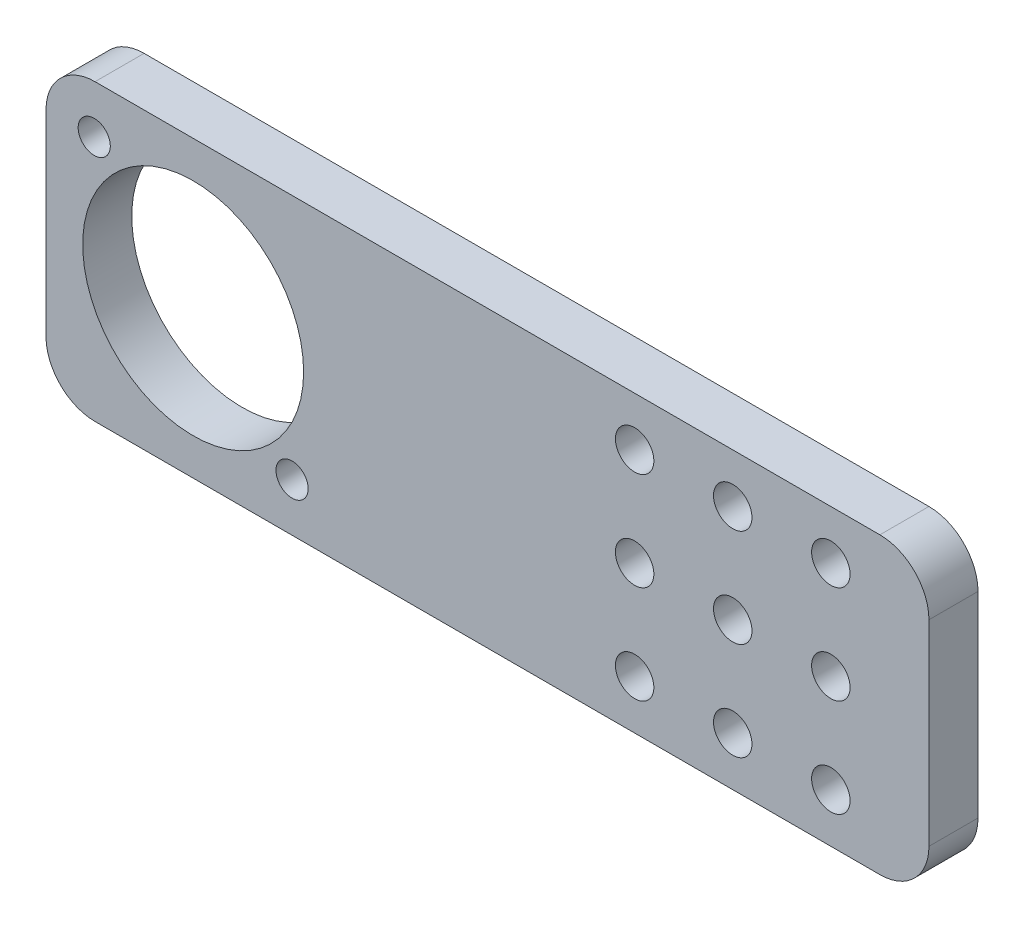
ISO-10303-21;
HEADER;
FILE_DESCRIPTION(('STEP AP214'),'2;1');
FILE_NAME('part.step','',(''),(''),'','','');
FILE_SCHEMA(('AUTOMOTIVE_DESIGN { 1 0 10303 214 1 1 1 1 }'));
ENDSEC;
DATA;
#1=APPLICATION_CONTEXT('core data for automotive mechanical design processes');
#2=APPLICATION_PROTOCOL_DEFINITION('international standard','automotive_design',2000,#1);
#3=PRODUCT_CONTEXT('',#1,'mechanical');
#4=PRODUCT('Part','Part','',(#3));
#5=PRODUCT_RELATED_PRODUCT_CATEGORY('part','',(#4));
#6=PRODUCT_DEFINITION_FORMATION('','',#4);
#7=PRODUCT_DEFINITION_CONTEXT('part definition',#1,'design');
#8=PRODUCT_DEFINITION('design','',#6,#7);
#9=PRODUCT_DEFINITION_SHAPE('','',#8);
#10=(LENGTH_UNIT() NAMED_UNIT(*) SI_UNIT(.MILLI.,.METRE.));
#11=(NAMED_UNIT(*) PLANE_ANGLE_UNIT() SI_UNIT($,.RADIAN.));
#12=(NAMED_UNIT(*) SI_UNIT($,.STERADIAN.) SOLID_ANGLE_UNIT());
#13=UNCERTAINTY_MEASURE_WITH_UNIT(LENGTH_MEASURE(1.E-05),#10,'distance_accuracy_value','');
#14=(GEOMETRIC_REPRESENTATION_CONTEXT(3) GLOBAL_UNCERTAINTY_ASSIGNED_CONTEXT((#13)) GLOBAL_UNIT_ASSIGNED_CONTEXT((#10,
#11,#12)) REPRESENTATION_CONTEXT('',''));
#15=CARTESIAN_POINT('',(0.,0.,0.));
#16=DIRECTION('',(0.,0.,1.));
#17=DIRECTION('',(1.,0.,0.));
#18=AXIS2_PLACEMENT_3D('',#15,#16,#17);
#19=CARTESIAN_POINT('',(-57.15,1159.64261389653,6.35000000000018));
#20=DIRECTION('',(0.,0.,1.));
#21=DIRECTION('',(1.,0.,0.));
#22=AXIS2_PLACEMENT_3D('',#19,#20,#21);
#23=PLANE('',#22);
#24=CARTESIAN_POINT('',(-95.25,1159.64261389653,6.35000000000018));
#25=DIRECTION('',(0.,0.,-1.));
#26=DIRECTION('',(-1.,0.,0.));
#27=AXIS2_PLACEMENT_3D('',#24,#25,#26);
#28=CIRCLE('',#27,14.3002);
#29=CARTESIAN_POINT('',(-80.9498,1159.64261389653,6.35000000000018));
#30=VERTEX_POINT('',#29);
#31=EDGE_CURVE('E282',#30,#30,#28,.T.);
#32=ORIENTED_EDGE('',*,*,#31,.T.);
#33=EDGE_LOOP('',(#32));
#34=FACE_BOUND('',#33,.T.);
#35=CARTESIAN_POINT('',(-108.055845228645,1172.44845912518,6.35000000000018));
#36=DIRECTION('',(0.,0.,-1.));
#37=DIRECTION('',(-1.,0.,0.));
#38=AXIS2_PLACEMENT_3D('',#35,#36,#37);
#39=CIRCLE('',#38,2.0828);
#40=CARTESIAN_POINT('',(-105.973045228645,1172.44845912518,6.35000000000018));
#41=VERTEX_POINT('',#40);
#42=EDGE_CURVE('E281',#41,#41,#39,.T.);
#43=ORIENTED_EDGE('',*,*,#42,.T.);
#44=EDGE_LOOP('',(#43));
#45=FACE_BOUND('',#44,.T.);
#46=CARTESIAN_POINT('',(-82.4441547713553,1146.83676866789,6.35000000000018));
#47=DIRECTION('',(0.,0.,-1.));
#48=DIRECTION('',(-1.,0.,0.));
#49=AXIS2_PLACEMENT_3D('',#46,#47,#48);
#50=CIRCLE('',#49,2.0828);
#51=CARTESIAN_POINT('',(-80.3613547713553,1146.83676866789,6.35000000000018));
#52=VERTEX_POINT('',#51);
#53=EDGE_CURVE('E421',#52,#52,#50,.T.);
#54=ORIENTED_EDGE('',*,*,#53,.T.);
#55=EDGE_LOOP('',(#54));
#56=FACE_BOUND('',#55,.T.);
#57=CARTESIAN_POINT('',(-38.1,1159.64261389653,6.35000000000018));
#58=DIRECTION('',(0.,0.,-1.));
#59=DIRECTION('',(1.,0.,0.));
#60=AXIS2_PLACEMENT_3D('',#57,#58,#59);
#61=CIRCLE('',#60,2.4892);
#62=CARTESIAN_POINT('',(-40.5892,1159.64261389653,6.35000000000018));
#63=VERTEX_POINT('',#62);
#64=EDGE_CURVE('E339',#63,#63,#61,.T.);
#65=ORIENTED_EDGE('',*,*,#64,.T.);
#66=EDGE_LOOP('',(#65));
#67=FACE_BOUND('',#66,.T.);
#68=CARTESIAN_POINT('',(-38.1,1146.94261389653,6.35000000000018));
#69=DIRECTION('',(0.,0.,-1.));
#70=DIRECTION('',(1.,0.,0.));
#71=AXIS2_PLACEMENT_3D('',#68,#69,#70);
#72=CIRCLE('',#71,2.4892);
#73=CARTESIAN_POINT('',(-40.5892,1146.94261389653,6.35000000000018));
#74=VERTEX_POINT('',#73);
#75=EDGE_CURVE('E361',#74,#74,#72,.T.);
#76=ORIENTED_EDGE('',*,*,#75,.T.);
#77=EDGE_LOOP('',(#76));
#78=FACE_BOUND('',#77,.T.);
#79=CARTESIAN_POINT('',(-25.4,1146.94261389653,6.35000000000018));
#80=DIRECTION('',(0.,0.,-1.));
#81=DIRECTION('',(1.,0.,0.));
#82=AXIS2_PLACEMENT_3D('',#79,#80,#81);
#83=CIRCLE('',#82,2.4892);
#84=CARTESIAN_POINT('',(-27.8892,1146.94261389653,6.35000000000018));
#85=VERTEX_POINT('',#84);
#86=EDGE_CURVE('E362',#85,#85,#83,.T.);
#87=ORIENTED_EDGE('',*,*,#86,.T.);
#88=EDGE_LOOP('',(#87));
#89=FACE_BOUND('',#88,.T.);
#90=CARTESIAN_POINT('',(-25.4,1172.34261389653,6.35000000000018));
#91=DIRECTION('',(0.,0.,-1.));
#92=DIRECTION('',(1.,0.,0.));
#93=AXIS2_PLACEMENT_3D('',#90,#91,#92);
#94=CIRCLE('',#93,2.4892);
#95=CARTESIAN_POINT('',(-27.8892,1172.34261389653,6.35000000000018));
#96=VERTEX_POINT('',#95);
#97=EDGE_CURVE('E395',#96,#96,#94,.T.);
#98=ORIENTED_EDGE('',*,*,#97,.T.);
#99=EDGE_LOOP('',(#98));
#100=FACE_BOUND('',#99,.T.);
#101=CARTESIAN_POINT('',(-25.4,1159.64261389653,6.35000000000018));
#102=DIRECTION('',(0.,0.,-1.));
#103=DIRECTION('',(1.,0.,0.));
#104=AXIS2_PLACEMENT_3D('',#101,#102,#103);
#105=CIRCLE('',#104,2.4892);
#106=CARTESIAN_POINT('',(-27.8892,1159.64261389653,6.35000000000018));
#107=VERTEX_POINT('',#106);
#108=EDGE_CURVE('E388',#107,#107,#105,.T.);
#109=ORIENTED_EDGE('',*,*,#108,.T.);
#110=EDGE_LOOP('',(#109));
#111=FACE_BOUND('',#110,.T.);
#112=CARTESIAN_POINT('',(-38.1,1172.34261389653,6.35000000000018));
#113=DIRECTION('',(0.,0.,-1.));
#114=DIRECTION('',(1.,0.,0.));
#115=AXIS2_PLACEMENT_3D('',#112,#113,#114);
#116=CIRCLE('',#115,2.4892);
#117=CARTESIAN_POINT('',(-40.5892,1172.34261389653,6.35000000000018));
#118=VERTEX_POINT('',#117);
#119=EDGE_CURVE('E296',#118,#118,#116,.T.);
#120=ORIENTED_EDGE('',*,*,#119,.T.);
#121=EDGE_LOOP('',(#120));
#122=FACE_BOUND('',#121,.T.);
#123=CARTESIAN_POINT('',(-12.6999999999998,1146.94261389653,6.35000000000018));
#124=DIRECTION('',(0.,0.,-1.));
#125=DIRECTION('',(1.,0.,0.));
#126=AXIS2_PLACEMENT_3D('',#123,#124,#125);
#127=CIRCLE('',#126,2.4892);
#128=CARTESIAN_POINT('',(-15.1892,1146.94261389653,6.35000000000018));
#129=VERTEX_POINT('',#128);
#130=EDGE_CURVE('E297',#129,#129,#127,.T.);
#131=ORIENTED_EDGE('',*,*,#130,.T.);
#132=EDGE_LOOP('',(#131));
#133=FACE_BOUND('',#132,.T.);
#134=CARTESIAN_POINT('',(-12.6999999999999,1172.34261389653,6.35000000000018));
#135=DIRECTION('',(0.,0.,-1.));
#136=DIRECTION('',(1.,0.,0.));
#137=AXIS2_PLACEMENT_3D('',#134,#135,#136);
#138=CIRCLE('',#137,2.4892);
#139=CARTESIAN_POINT('',(-15.1892,1172.34261389653,6.35000000000018));
#140=VERTEX_POINT('',#139);
#141=EDGE_CURVE('E319',#140,#140,#138,.T.);
#142=ORIENTED_EDGE('',*,*,#141,.T.);
#143=EDGE_LOOP('',(#142));
#144=FACE_BOUND('',#143,.T.);
#145=CARTESIAN_POINT('',(-12.6999999999999,1159.64261389653,6.35000000000018));
#146=DIRECTION('',(0.,0.,-1.));
#147=DIRECTION('',(1.,0.,0.));
#148=AXIS2_PLACEMENT_3D('',#145,#146,#147);
#149=CIRCLE('',#148,2.4892);
#150=CARTESIAN_POINT('',(-15.1892,1159.64261389653,6.35000000000018));
#151=VERTEX_POINT('',#150);
#152=EDGE_CURVE('E369',#151,#151,#149,.T.);
#153=ORIENTED_EDGE('',*,*,#152,.T.);
#154=EDGE_LOOP('',(#153));
#155=FACE_BOUND('',#154,.T.);
#156=CARTESIAN_POINT('',(-6.34999999999985,1146.94261389653,6.35000000000018));
#157=DIRECTION('',(0.,0.,-1.));
#158=DIRECTION('',(0.707106781186552,-0.707106781186543,0.));
#159=AXIS2_PLACEMENT_3D('',#156,#157,#158);
#160=CIRCLE('',#159,6.35);
#161=CARTESIAN_POINT('',(1.39115793291948E-13,1146.94261389653,6.35000000000018));
#162=VERTEX_POINT('',#161);
#163=CARTESIAN_POINT('',(-6.34999999999985,1140.59261389653,6.35000000000018));
#164=VERTEX_POINT('',#163);
#165=EDGE_CURVE('E220',#162,#164,#160,.T.);
#166=ORIENTED_EDGE('',*,*,#165,.F.);
#167=DIRECTION('',(0.,1.,0.));
#168=VECTOR('',#167,1.);
#169=CARTESIAN_POINT('',(1.40848710871646E-13,1140.59261389653,6.35000000000018));
#170=LINE('',#169,#168);
#171=CARTESIAN_POINT('',(1.32184122973154E-13,1172.34261389653,6.35000000000018));
#172=VERTEX_POINT('',#171);
#173=EDGE_CURVE('E202',#162,#172,#170,.T.);
#174=ORIENTED_EDGE('',*,*,#173,.T.);
#175=CARTESIAN_POINT('',(-6.34999999999987,1172.34261389653,6.35000000000018));
#176=DIRECTION('',(0.,0.,-1.));
#177=DIRECTION('',(0.707106781186537,0.707106781186558,0.));
#178=AXIS2_PLACEMENT_3D('',#175,#176,#177);
#179=CIRCLE('',#178,6.35);
#180=CARTESIAN_POINT('',(-6.34999999999987,1178.69261389653,6.35000000000018));
#181=VERTEX_POINT('',#180);
#182=EDGE_CURVE('E247',#181,#172,#179,.T.);
#183=ORIENTED_EDGE('',*,*,#182,.F.);
#184=DIRECTION('',(-1.,0.,0.));
#185=VECTOR('',#184,1.);
#186=CARTESIAN_POINT('',(1.30451205393456E-13,1178.69261389653,6.35000000000018));
#187=LINE('',#186,#185);
#188=CARTESIAN_POINT('',(-107.95,1178.69261389653,6.35000000000018));
#189=VERTEX_POINT('',#188);
#190=EDGE_CURVE('E258',#181,#189,#187,.T.);
#191=ORIENTED_EDGE('',*,*,#190,.T.);
#192=CARTESIAN_POINT('',(-107.95,1172.34261389653,6.35000000000018));
#193=DIRECTION('',(0.,0.,-1.));
#194=DIRECTION('',(-0.707106781186553,0.707106781186542,0.));
#195=AXIS2_PLACEMENT_3D('',#192,#193,#194);
#196=CIRCLE('',#195,6.35);
#197=CARTESIAN_POINT('',(-114.3,1172.34261389653,6.35000000000018));
#198=VERTEX_POINT('',#197);
#199=EDGE_CURVE('E262',#198,#189,#196,.T.);
#200=ORIENTED_EDGE('',*,*,#199,.F.);
#201=DIRECTION('',(0.,-1.,0.));
#202=VECTOR('',#201,1.);
#203=CARTESIAN_POINT('',(-114.3,1178.69261389653,6.35000000000018));
#204=LINE('',#203,#202);
#205=CARTESIAN_POINT('',(-114.3,1146.94261389653,6.35000000000018));
#206=VERTEX_POINT('',#205);
#207=EDGE_CURVE('E353',#198,#206,#204,.T.);
#208=ORIENTED_EDGE('',*,*,#207,.T.);
#209=CARTESIAN_POINT('',(-107.95,1146.94261389653,6.35000000000018));
#210=DIRECTION('',(0.,0.,-1.));
#211=DIRECTION('',(-0.707106781186536,-0.707106781186559,0.));
#212=AXIS2_PLACEMENT_3D('',#209,#210,#211);
#213=CIRCLE('',#212,6.35);
#214=CARTESIAN_POINT('',(-107.95,1140.59261389653,6.35000000000018));
#215=VERTEX_POINT('',#214);
#216=EDGE_CURVE('E357',#215,#206,#213,.T.);
#217=ORIENTED_EDGE('',*,*,#216,.F.);
#218=DIRECTION('',(1.,0.,0.));
#219=VECTOR('',#218,1.);
#220=CARTESIAN_POINT('',(-114.3,1140.59261389653,6.35000000000018));
#221=LINE('',#220,#219);
#222=EDGE_CURVE('E11',#215,#164,#221,.T.);
#223=ORIENTED_EDGE('',*,*,#222,.T.);
#224=EDGE_LOOP('',(#166,#174,#183,#191,#200,#208,#217,#223));
#225=FACE_BOUND('',#224,.T.);
#226=ADVANCED_FACE('F17',(#34,#45,#56,#67,#78,#89,#100,#111,#122,#133,#144,#155,#225),#23,.T.);
#227=CARTESIAN_POINT('',(-114.3,1140.59261389653,1.70974345792274E-13));
#228=DIRECTION('',(0.,-1.,0.));
#229=DIRECTION('',(0.,0.,-1.));
#230=AXIS2_PLACEMENT_3D('',#227,#228,#229);
#231=PLANE('',#230);
#232=DIRECTION('',(0.,0.,-1.));
#233=VECTOR('',#232,1.);
#234=CARTESIAN_POINT('',(-6.34999999999985,1140.59261389653,1.70974345792274E-13));
#235=LINE('',#234,#233);
#236=CARTESIAN_POINT('',(-6.34999999999985,1140.59261389653,1.70974345792274E-13));
#237=VERTEX_POINT('',#236);
#238=EDGE_CURVE('E229',#164,#237,#235,.T.);
#239=ORIENTED_EDGE('',*,*,#238,.F.);
#240=ORIENTED_EDGE('',*,*,#222,.F.);
#241=DIRECTION('',(0.,0.,1.));
#242=VECTOR('',#241,1.);
#243=CARTESIAN_POINT('',(-107.95,1140.59261389653,1.70974345792274E-13));
#244=LINE('',#243,#242);
#245=CARTESIAN_POINT('',(-107.95,1140.59261389653,1.70974345792274E-13));
#246=VERTEX_POINT('',#245);
#247=EDGE_CURVE('E365',#246,#215,#244,.T.);
#248=ORIENTED_EDGE('',*,*,#247,.F.);
#249=DIRECTION('',(1.,0.,0.));
#250=VECTOR('',#249,1.);
#251=CARTESIAN_POINT('',(-114.3,1140.59261389653,1.70974345792274E-13));
#252=LINE('',#251,#250);
#253=EDGE_CURVE('E214',#246,#237,#252,.T.);
#254=ORIENTED_EDGE('',*,*,#253,.T.);
#255=EDGE_LOOP('',(#239,#240,#248,#254));
#256=FACE_BOUND('',#255,.T.);
#257=ADVANCED_FACE('F19',(#256),#231,.T.);
#258=CARTESIAN_POINT('',(-82.4441547713553,1146.83676866789,1.70974345792274E-13));
#259=DIRECTION('',(0.,0.,1.));
#260=DIRECTION('',(-1.,0.,0.));
#261=AXIS2_PLACEMENT_3D('',#258,#259,#260);
#262=CYLINDRICAL_SURFACE('',#261,2.0828);
#263=ORIENTED_EDGE('',*,*,#53,.F.);
#264=DIRECTION('',(0.,0.,-1.));
#265=VECTOR('',#264,1.);
#266=CARTESIAN_POINT('',(-80.3613547713553,1146.83676866789,1.70974345792274E-13));
#267=LINE('',#266,#265);
#268=CARTESIAN_POINT('',(-80.3613547713553,1146.83676866789,1.70974345792274E-13));
#269=VERTEX_POINT('',#268);
#270=EDGE_CURVE('E26',#52,#269,#267,.T.);
#271=ORIENTED_EDGE('',*,*,#270,.T.);
#272=CARTESIAN_POINT('',(-82.4441547713553,1146.83676866789,1.70974345792274E-13));
#273=DIRECTION('',(0.,0.,-1.));
#274=DIRECTION('',(-1.,0.,0.));
#275=AXIS2_PLACEMENT_3D('',#272,#273,#274);
#276=CIRCLE('',#275,2.0828);
#277=EDGE_CURVE('E331',#269,#269,#276,.T.);
#278=ORIENTED_EDGE('',*,*,#277,.T.);
#279=ORIENTED_EDGE('',*,*,#270,.F.);
#280=EDGE_LOOP('',(#263,#271,#278,#279));
#281=FACE_BOUND('',#280,.T.);
#282=ADVANCED_FACE('F426',(#281),#262,.F.);
#283=CARTESIAN_POINT('',(-108.055845228645,1172.44845912518,1.70974345792274E-13));
#284=DIRECTION('',(0.,0.,1.));
#285=DIRECTION('',(-1.,0.,0.));
#286=AXIS2_PLACEMENT_3D('',#283,#284,#285);
#287=CYLINDRICAL_SURFACE('',#286,2.0828);
#288=ORIENTED_EDGE('',*,*,#42,.F.);
#289=DIRECTION('',(0.,0.,-1.));
#290=VECTOR('',#289,1.);
#291=CARTESIAN_POINT('',(-105.973045228645,1172.44845912518,1.70974345792274E-13));
#292=LINE('',#291,#290);
#293=CARTESIAN_POINT('',(-105.973045228645,1172.44845912518,1.70974345792274E-13));
#294=VERTEX_POINT('',#293);
#295=EDGE_CURVE('E47',#41,#294,#292,.T.);
#296=ORIENTED_EDGE('',*,*,#295,.T.);
#297=CARTESIAN_POINT('',(-108.055845228645,1172.44845912518,1.70974345792274E-13));
#298=DIRECTION('',(0.,0.,-1.));
#299=DIRECTION('',(-1.,0.,0.));
#300=AXIS2_PLACEMENT_3D('',#297,#298,#299);
#301=CIRCLE('',#300,2.0828);
#302=EDGE_CURVE('E269',#294,#294,#301,.T.);
#303=ORIENTED_EDGE('',*,*,#302,.T.);
#304=ORIENTED_EDGE('',*,*,#295,.F.);
#305=EDGE_LOOP('',(#288,#296,#303,#304));
#306=FACE_BOUND('',#305,.T.);
#307=ADVANCED_FACE('F533',(#306),#287,.F.);
#308=CARTESIAN_POINT('',(-95.25,1159.64261389653,1.70974345792274E-13));
#309=DIRECTION('',(0.,0.,1.));
#310=DIRECTION('',(-1.,0.,0.));
#311=AXIS2_PLACEMENT_3D('',#308,#309,#310);
#312=CYLINDRICAL_SURFACE('',#311,14.3002);
#313=ORIENTED_EDGE('',*,*,#31,.F.);
#314=DIRECTION('',(0.,0.,-1.));
#315=VECTOR('',#314,1.);
#316=CARTESIAN_POINT('',(-80.9498,1159.64261389653,1.70974345792274E-13));
#317=LINE('',#316,#315);
#318=CARTESIAN_POINT('',(-80.9498,1159.64261389653,1.70974345792274E-13));
#319=VERTEX_POINT('',#318);
#320=EDGE_CURVE('E278',#30,#319,#317,.T.);
#321=ORIENTED_EDGE('',*,*,#320,.T.);
#322=CARTESIAN_POINT('',(-95.25,1159.64261389653,1.70974345792274E-13));
#323=DIRECTION('',(0.,0.,-1.));
#324=DIRECTION('',(-1.,0.,0.));
#325=AXIS2_PLACEMENT_3D('',#322,#323,#324);
#326=CIRCLE('',#325,14.3002);
#327=EDGE_CURVE('E265',#319,#319,#326,.T.);
#328=ORIENTED_EDGE('',*,*,#327,.T.);
#329=ORIENTED_EDGE('',*,*,#320,.F.);
#330=EDGE_LOOP('',(#313,#321,#328,#329));
#331=FACE_BOUND('',#330,.T.);
#332=ADVANCED_FACE('F529',(#331),#312,.F.);
#333=CARTESIAN_POINT('',(-38.1,1159.64261389653,6.35000000000018));
#334=DIRECTION('',(0.,0.,-1.));
#335=DIRECTION('',(1.,0.,0.));
#336=AXIS2_PLACEMENT_3D('',#333,#334,#335);
#337=CYLINDRICAL_SURFACE('',#336,2.4892);
#338=ORIENTED_EDGE('',*,*,#64,.F.);
#339=DIRECTION('',(0.,0.,-1.));
#340=VECTOR('',#339,1.);
#341=CARTESIAN_POINT('',(-40.5892,1159.64261389653,6.35000000000018));
#342=LINE('',#341,#340);
#343=CARTESIAN_POINT('',(-40.5892,1159.64261389653,1.70974345792274E-13));
#344=VERTEX_POINT('',#343);
#345=EDGE_CURVE('E336',#63,#344,#342,.T.);
#346=ORIENTED_EDGE('',*,*,#345,.T.);
#347=CARTESIAN_POINT('',(-38.1,1159.64261389653,1.70974345792274E-13));
#348=DIRECTION('',(0.,0.,1.));
#349=DIRECTION('',(1.,0.,0.));
#350=AXIS2_PLACEMENT_3D('',#347,#348,#349);
#351=CIRCLE('',#350,2.4892);
#352=EDGE_CURVE('E327',#344,#344,#351,.T.);
#353=ORIENTED_EDGE('',*,*,#352,.F.);
#354=ORIENTED_EDGE('',*,*,#345,.F.);
#355=EDGE_LOOP('',(#338,#346,#353,#354));
#356=FACE_BOUND('',#355,.T.);
#357=ADVANCED_FACE('F502',(#356),#337,.F.);
#358=CARTESIAN_POINT('',(-38.1,1146.94261389653,6.35000000000018));
#359=DIRECTION('',(0.,0.,-1.));
#360=DIRECTION('',(1.,0.,0.));
#361=AXIS2_PLACEMENT_3D('',#358,#359,#360);
#362=CYLINDRICAL_SURFACE('',#361,2.4892);
#363=ORIENTED_EDGE('',*,*,#75,.F.);
#364=DIRECTION('',(0.,0.,-1.));
#365=VECTOR('',#364,1.);
#366=CARTESIAN_POINT('',(-40.5892,1146.94261389653,6.35000000000018));
#367=LINE('',#366,#365);
#368=CARTESIAN_POINT('',(-40.5892,1146.94261389653,1.70974345792274E-13));
#369=VERTEX_POINT('',#368);
#370=EDGE_CURVE('E408',#74,#369,#367,.T.);
#371=ORIENTED_EDGE('',*,*,#370,.T.);
#372=CARTESIAN_POINT('',(-38.1,1146.94261389653,1.70974345792274E-13));
#373=DIRECTION('',(0.,0.,1.));
#374=DIRECTION('',(1.,0.,0.));
#375=AXIS2_PLACEMENT_3D('',#372,#373,#374);
#376=CIRCLE('',#375,2.4892);
#377=EDGE_CURVE('E323',#369,#369,#376,.T.);
#378=ORIENTED_EDGE('',*,*,#377,.F.);
#379=ORIENTED_EDGE('',*,*,#370,.F.);
#380=EDGE_LOOP('',(#363,#371,#378,#379));
#381=FACE_BOUND('',#380,.T.);
#382=ADVANCED_FACE('F499',(#381),#362,.F.);
#383=CARTESIAN_POINT('',(-25.4,1146.94261389653,6.35000000000018));
#384=DIRECTION('',(0.,0.,-1.));
#385=DIRECTION('',(1.,0.,0.));
#386=AXIS2_PLACEMENT_3D('',#383,#384,#385);
#387=CYLINDRICAL_SURFACE('',#386,2.4892);
#388=ORIENTED_EDGE('',*,*,#86,.F.);
#389=DIRECTION('',(0.,0.,-1.));
#390=VECTOR('',#389,1.);
#391=CARTESIAN_POINT('',(-27.8892,1146.94261389653,6.35000000000018));
#392=LINE('',#391,#390);
#393=CARTESIAN_POINT('',(-27.8892,1146.94261389653,1.70974345792274E-13));
#394=VERTEX_POINT('',#393);
#395=EDGE_CURVE('E358',#85,#394,#392,.T.);
#396=ORIENTED_EDGE('',*,*,#395,.T.);
#397=CARTESIAN_POINT('',(-25.4,1146.94261389653,1.70974345792274E-13));
#398=DIRECTION('',(0.,0.,1.));
#399=DIRECTION('',(1.,0.,0.));
#400=AXIS2_PLACEMENT_3D('',#397,#398,#399);
#401=CIRCLE('',#400,2.4892);
#402=EDGE_CURVE('E275',#394,#394,#401,.T.);
#403=ORIENTED_EDGE('',*,*,#402,.F.);
#404=ORIENTED_EDGE('',*,*,#395,.F.);
#405=EDGE_LOOP('',(#388,#396,#403,#404));
#406=FACE_BOUND('',#405,.T.);
#407=ADVANCED_FACE('F501',(#406),#387,.F.);
#408=CARTESIAN_POINT('',(-25.4,1172.34261389653,6.35000000000018));
#409=DIRECTION('',(0.,0.,-1.));
#410=DIRECTION('',(1.,0.,0.));
#411=AXIS2_PLACEMENT_3D('',#408,#409,#410);
#412=CYLINDRICAL_SURFACE('',#411,2.4892);
#413=ORIENTED_EDGE('',*,*,#97,.F.);
#414=DIRECTION('',(0.,0.,-1.));
#415=VECTOR('',#414,1.);
#416=CARTESIAN_POINT('',(-27.8892,1172.34261389653,6.35000000000018));
#417=LINE('',#416,#415);
#418=CARTESIAN_POINT('',(-27.8892,1172.34261389653,1.70974345792274E-13));
#419=VERTEX_POINT('',#418);
#420=EDGE_CURVE('E396',#96,#419,#417,.T.);
#421=ORIENTED_EDGE('',*,*,#420,.T.);
#422=CARTESIAN_POINT('',(-25.4,1172.34261389653,1.70974345792274E-13));
#423=DIRECTION('',(0.,0.,1.));
#424=DIRECTION('',(1.,0.,0.));
#425=AXIS2_PLACEMENT_3D('',#422,#423,#424);
#426=CIRCLE('',#425,2.4892);
#427=EDGE_CURVE('E272',#419,#419,#426,.T.);
#428=ORIENTED_EDGE('',*,*,#427,.F.);
#429=ORIENTED_EDGE('',*,*,#420,.F.);
#430=EDGE_LOOP('',(#413,#421,#428,#429));
#431=FACE_BOUND('',#430,.T.);
#432=ADVANCED_FACE('F511',(#431),#412,.F.);
#433=CARTESIAN_POINT('',(-25.4,1159.64261389653,6.35000000000018));
#434=DIRECTION('',(0.,0.,-1.));
#435=DIRECTION('',(1.,0.,0.));
#436=AXIS2_PLACEMENT_3D('',#433,#434,#435);
#437=CYLINDRICAL_SURFACE('',#436,2.4892);
#438=ORIENTED_EDGE('',*,*,#108,.F.);
#439=DIRECTION('',(0.,0.,-1.));
#440=VECTOR('',#439,1.);
#441=CARTESIAN_POINT('',(-27.8892,1159.64261389653,6.35000000000018));
#442=LINE('',#441,#440);
#443=CARTESIAN_POINT('',(-27.8892,1159.64261389653,1.70974345792274E-13));
#444=VERTEX_POINT('',#443);
#445=EDGE_CURVE('E392',#107,#444,#442,.T.);
#446=ORIENTED_EDGE('',*,*,#445,.T.);
#447=CARTESIAN_POINT('',(-25.4,1159.64261389653,1.70974345792274E-13));
#448=DIRECTION('',(0.,0.,1.));
#449=DIRECTION('',(1.,0.,0.));
#450=AXIS2_PLACEMENT_3D('',#447,#448,#449);
#451=CIRCLE('',#450,2.4892);
#452=EDGE_CURVE('E276',#444,#444,#451,.T.);
#453=ORIENTED_EDGE('',*,*,#452,.F.);
#454=ORIENTED_EDGE('',*,*,#445,.F.);
#455=EDGE_LOOP('',(#438,#446,#453,#454));
#456=FACE_BOUND('',#455,.T.);
#457=ADVANCED_FACE('F519',(#456),#437,.F.);
#458=CARTESIAN_POINT('',(-38.1,1172.34261389653,6.35000000000018));
#459=DIRECTION('',(0.,0.,-1.));
#460=DIRECTION('',(1.,0.,0.));
#461=AXIS2_PLACEMENT_3D('',#458,#459,#460);
#462=CYLINDRICAL_SURFACE('',#461,2.4892);
#463=ORIENTED_EDGE('',*,*,#119,.F.);
#464=DIRECTION('',(0.,0.,-1.));
#465=VECTOR('',#464,1.);
#466=CARTESIAN_POINT('',(-40.5892,1172.34261389653,6.35000000000018));
#467=LINE('',#466,#465);
#468=CARTESIAN_POINT('',(-40.5892,1172.34261389653,1.70974345792274E-13));
#469=VERTEX_POINT('',#468);
#470=EDGE_CURVE('E385',#118,#469,#467,.T.);
#471=ORIENTED_EDGE('',*,*,#470,.T.);
#472=CARTESIAN_POINT('',(-38.1,1172.34261389653,1.70974345792274E-13));
#473=DIRECTION('',(0.,0.,1.));
#474=DIRECTION('',(1.,0.,0.));
#475=AXIS2_PLACEMENT_3D('',#472,#473,#474);
#476=CIRCLE('',#475,2.4892);
#477=EDGE_CURVE('E309',#469,#469,#476,.T.);
#478=ORIENTED_EDGE('',*,*,#477,.F.);
#479=ORIENTED_EDGE('',*,*,#470,.F.);
#480=EDGE_LOOP('',(#463,#471,#478,#479));
#481=FACE_BOUND('',#480,.T.);
#482=ADVANCED_FACE('F515',(#481),#462,.F.);
#483=CARTESIAN_POINT('',(-12.6999999999998,1146.94261389653,6.35000000000018));
#484=DIRECTION('',(0.,0.,-1.));
#485=DIRECTION('',(1.,0.,0.));
#486=AXIS2_PLACEMENT_3D('',#483,#484,#485);
#487=CYLINDRICAL_SURFACE('',#486,2.4892);
#488=ORIENTED_EDGE('',*,*,#130,.F.);
#489=DIRECTION('',(0.,0.,-1.));
#490=VECTOR('',#489,1.);
#491=CARTESIAN_POINT('',(-15.1892,1146.94261389653,6.35000000000018));
#492=LINE('',#491,#490);
#493=CARTESIAN_POINT('',(-15.1892,1146.94261389653,1.70974345792274E-13));
#494=VERTEX_POINT('',#493);
#495=EDGE_CURVE('E293',#129,#494,#492,.T.);
#496=ORIENTED_EDGE('',*,*,#495,.T.);
#497=CARTESIAN_POINT('',(-12.6999999999998,1146.94261389653,1.70974345792274E-13));
#498=DIRECTION('',(0.,0.,1.));
#499=DIRECTION('',(1.,0.,0.));
#500=AXIS2_PLACEMENT_3D('',#497,#498,#499);
#501=CIRCLE('',#500,2.4892);
#502=EDGE_CURVE('E305',#494,#494,#501,.T.);
#503=ORIENTED_EDGE('',*,*,#502,.F.);
#504=ORIENTED_EDGE('',*,*,#495,.F.);
#505=EDGE_LOOP('',(#488,#496,#503,#504));
#506=FACE_BOUND('',#505,.T.);
#507=ADVANCED_FACE('F494',(#506),#487,.F.);
#508=CARTESIAN_POINT('',(-12.6999999999999,1172.34261389653,6.35000000000018));
#509=DIRECTION('',(0.,0.,-1.));
#510=DIRECTION('',(1.,0.,0.));
#511=AXIS2_PLACEMENT_3D('',#508,#509,#510);
#512=CYLINDRICAL_SURFACE('',#511,2.4892);
#513=ORIENTED_EDGE('',*,*,#141,.F.);
#514=DIRECTION('',(0.,0.,-1.));
#515=VECTOR('',#514,1.);
#516=CARTESIAN_POINT('',(-15.1892,1172.34261389653,6.35000000000018));
#517=LINE('',#516,#515);
#518=CARTESIAN_POINT('',(-15.1892,1172.34261389653,1.70974345792274E-13));
#519=VERTEX_POINT('',#518);
#520=EDGE_CURVE('E316',#140,#519,#517,.T.);
#521=ORIENTED_EDGE('',*,*,#520,.T.);
#522=CARTESIAN_POINT('',(-12.6999999999999,1172.34261389653,1.70974345792274E-13));
#523=DIRECTION('',(0.,0.,1.));
#524=DIRECTION('',(1.,0.,0.));
#525=AXIS2_PLACEMENT_3D('',#522,#523,#524);
#526=CIRCLE('',#525,2.4892);
#527=EDGE_CURVE('E301',#519,#519,#526,.T.);
#528=ORIENTED_EDGE('',*,*,#527,.F.);
#529=ORIENTED_EDGE('',*,*,#520,.F.);
#530=EDGE_LOOP('',(#513,#521,#528,#529));
#531=FACE_BOUND('',#530,.T.);
#532=ADVANCED_FACE('F492',(#531),#512,.F.);
#533=CARTESIAN_POINT('',(-12.6999999999999,1159.64261389653,6.35000000000018));
#534=DIRECTION('',(0.,0.,-1.));
#535=DIRECTION('',(1.,0.,0.));
#536=AXIS2_PLACEMENT_3D('',#533,#534,#535);
#537=CYLINDRICAL_SURFACE('',#536,2.4892);
#538=ORIENTED_EDGE('',*,*,#152,.F.);
#539=DIRECTION('',(0.,0.,-1.));
#540=VECTOR('',#539,1.);
#541=CARTESIAN_POINT('',(-15.1892,1159.64261389653,6.35000000000018));
#542=LINE('',#541,#540);
#543=CARTESIAN_POINT('',(-15.1892,1159.64261389653,1.70974345792274E-13));
#544=VERTEX_POINT('',#543);
#545=EDGE_CURVE('E373',#151,#544,#542,.T.);
#546=ORIENTED_EDGE('',*,*,#545,.T.);
#547=CARTESIAN_POINT('',(-12.6999999999999,1159.64261389653,1.70974345792274E-13));
#548=DIRECTION('',(0.,0.,1.));
#549=DIRECTION('',(1.,0.,0.));
#550=AXIS2_PLACEMENT_3D('',#547,#548,#549);
#551=CIRCLE('',#550,2.4892);
#552=EDGE_CURVE('E292',#544,#544,#551,.T.);
#553=ORIENTED_EDGE('',*,*,#552,.F.);
#554=ORIENTED_EDGE('',*,*,#545,.F.);
#555=EDGE_LOOP('',(#538,#546,#553,#554));
#556=FACE_BOUND('',#555,.T.);
#557=ADVANCED_FACE('F451',(#556),#537,.F.);
#558=CARTESIAN_POINT('',(-107.95,1146.94261389653,1.70974345792274E-13));
#559=DIRECTION('',(0.,0.,1.));
#560=DIRECTION('',(-0.707106781186536,-0.707106781186559,0.));
#561=AXIS2_PLACEMENT_3D('',#558,#559,#560);
#562=CYLINDRICAL_SURFACE('',#561,6.35);
#563=ORIENTED_EDGE('',*,*,#216,.T.);
#564=DIRECTION('',(0.,0.,-1.));
#565=VECTOR('',#564,1.);
#566=CARTESIAN_POINT('',(-114.3,1146.94261389653,1.70974345792274E-13));
#567=LINE('',#566,#565);
#568=CARTESIAN_POINT('',(-114.3,1146.94261389653,1.70974345792274E-13));
#569=VERTEX_POINT('',#568);
#570=EDGE_CURVE('E350',#206,#569,#567,.T.);
#571=ORIENTED_EDGE('',*,*,#570,.T.);
#572=CARTESIAN_POINT('',(-107.95,1146.94261389653,1.70974345792274E-13));
#573=DIRECTION('',(0.,0.,1.));
#574=DIRECTION('',(-0.707106781186536,-0.707106781186559,0.));
#575=AXIS2_PLACEMENT_3D('',#572,#573,#574);
#576=CIRCLE('',#575,6.35);
#577=EDGE_CURVE('E237',#569,#246,#576,.T.);
#578=ORIENTED_EDGE('',*,*,#577,.T.);
#579=ORIENTED_EDGE('',*,*,#247,.T.);
#580=EDGE_LOOP('',(#563,#571,#578,#579));
#581=FACE_BOUND('',#580,.T.);
#582=ADVANCED_FACE('F464',(#581),#562,.T.);
#583=CARTESIAN_POINT('',(-114.3,1178.69261389653,1.70974345792274E-13));
#584=DIRECTION('',(-1.,0.,0.));
#585=DIRECTION('',(0.,1.,0.));
#586=AXIS2_PLACEMENT_3D('',#583,#584,#585);
#587=PLANE('',#586);
#588=DIRECTION('',(0.,0.,1.));
#589=VECTOR('',#588,1.);
#590=CARTESIAN_POINT('',(-114.3,1172.34261389653,1.70974345792274E-13));
#591=LINE('',#590,#589);
#592=CARTESIAN_POINT('',(-114.3,1172.34261389653,1.70974345792274E-13));
#593=VERTEX_POINT('',#592);
#594=EDGE_CURVE('E346',#593,#198,#591,.T.);
#595=ORIENTED_EDGE('',*,*,#594,.F.);
#596=DIRECTION('',(0.,-1.,0.));
#597=VECTOR('',#596,1.);
#598=CARTESIAN_POINT('',(-114.3,1178.69261389653,1.70974345792274E-13));
#599=LINE('',#598,#597);
#600=EDGE_CURVE('E240',#593,#569,#599,.T.);
#601=ORIENTED_EDGE('',*,*,#600,.T.);
#602=ORIENTED_EDGE('',*,*,#570,.F.);
#603=ORIENTED_EDGE('',*,*,#207,.F.);
#604=EDGE_LOOP('',(#595,#601,#602,#603));
#605=FACE_BOUND('',#604,.T.);
#606=ADVANCED_FACE('F470',(#605),#587,.T.);
#607=CARTESIAN_POINT('',(-107.95,1172.34261389653,1.70974345792274E-13));
#608=DIRECTION('',(0.,0.,1.));
#609=DIRECTION('',(-0.707106781186553,0.707106781186542,0.));
#610=AXIS2_PLACEMENT_3D('',#607,#608,#609);
#611=CYLINDRICAL_SURFACE('',#610,6.35);
#612=ORIENTED_EDGE('',*,*,#199,.T.);
#613=DIRECTION('',(0.,0.,-1.));
#614=VECTOR('',#613,1.);
#615=CARTESIAN_POINT('',(-107.95,1178.69261389653,1.70974345792274E-13));
#616=LINE('',#615,#614);
#617=CARTESIAN_POINT('',(-107.95,1178.69261389653,1.70974345792274E-13));
#618=VERTEX_POINT('',#617);
#619=EDGE_CURVE('E246',#189,#618,#616,.T.);
#620=ORIENTED_EDGE('',*,*,#619,.T.);
#621=CARTESIAN_POINT('',(-107.95,1172.34261389653,1.70974345792274E-13));
#622=DIRECTION('',(0.,0.,1.));
#623=DIRECTION('',(-0.707106781186553,0.707106781186542,0.));
#624=AXIS2_PLACEMENT_3D('',#621,#622,#623);
#625=CIRCLE('',#624,6.35);
#626=EDGE_CURVE('E257',#618,#593,#625,.T.);
#627=ORIENTED_EDGE('',*,*,#626,.T.);
#628=ORIENTED_EDGE('',*,*,#594,.T.);
#629=EDGE_LOOP('',(#612,#620,#627,#628));
#630=FACE_BOUND('',#629,.T.);
#631=ADVANCED_FACE('F473',(#630),#611,.T.);
#632=CARTESIAN_POINT('',(1.30451205393456E-13,1178.69261389653,1.70974345792274E-13));
#633=DIRECTION('',(0.,1.,0.));
#634=DIRECTION('',(1.,0.,0.));
#635=AXIS2_PLACEMENT_3D('',#632,#633,#634);
#636=PLANE('',#635);
#637=DIRECTION('',(0.,0.,1.));
#638=VECTOR('',#637,1.);
#639=CARTESIAN_POINT('',(-6.34999999999987,1178.69261389653,1.70974345792274E-13));
#640=LINE('',#639,#638);
#641=CARTESIAN_POINT('',(-6.34999999999987,1178.69261389653,1.70974345792274E-13));
#642=VERTEX_POINT('',#641);
#643=EDGE_CURVE('E242',#642,#181,#640,.T.);
#644=ORIENTED_EDGE('',*,*,#643,.F.);
#645=DIRECTION('',(-1.,0.,0.));
#646=VECTOR('',#645,1.);
#647=CARTESIAN_POINT('',(1.30451205393456E-13,1178.69261389653,1.70974345792274E-13));
#648=LINE('',#647,#646);
#649=EDGE_CURVE('E252',#642,#618,#648,.T.);
#650=ORIENTED_EDGE('',*,*,#649,.T.);
#651=ORIENTED_EDGE('',*,*,#619,.F.);
#652=ORIENTED_EDGE('',*,*,#190,.F.);
#653=EDGE_LOOP('',(#644,#650,#651,#652));
#654=FACE_BOUND('',#653,.T.);
#655=ADVANCED_FACE('F476',(#654),#636,.T.);
#656=CARTESIAN_POINT('',(-6.34999999999987,1172.34261389653,1.70974345792274E-13));
#657=DIRECTION('',(0.,0.,1.));
#658=DIRECTION('',(0.707106781186537,0.707106781186558,0.));
#659=AXIS2_PLACEMENT_3D('',#656,#657,#658);
#660=CYLINDRICAL_SURFACE('',#659,6.35);
#661=ORIENTED_EDGE('',*,*,#182,.T.);
#662=DIRECTION('',(0.,0.,-1.));
#663=VECTOR('',#662,1.);
#664=CARTESIAN_POINT('',(1.32116539930394E-13,1172.34261389653,1.70974345792274E-13));
#665=LINE('',#664,#663);
#666=CARTESIAN_POINT('',(1.32184122973154E-13,1172.34261389653,1.70974345792274E-13));
#667=VERTEX_POINT('',#666);
#668=EDGE_CURVE('E209',#172,#667,#665,.T.);
#669=ORIENTED_EDGE('',*,*,#668,.T.);
#670=CARTESIAN_POINT('',(-6.34999999999987,1172.34261389653,1.70974345792274E-13));
#671=DIRECTION('',(0.,0.,1.));
#672=DIRECTION('',(0.707106781186537,0.707106781186558,0.));
#673=AXIS2_PLACEMENT_3D('',#670,#671,#672);
#674=CIRCLE('',#673,6.35);
#675=EDGE_CURVE('E256',#667,#642,#674,.T.);
#676=ORIENTED_EDGE('',*,*,#675,.T.);
#677=ORIENTED_EDGE('',*,*,#643,.T.);
#678=EDGE_LOOP('',(#661,#669,#676,#677));
#679=FACE_BOUND('',#678,.T.);
#680=ADVANCED_FACE('F457',(#679),#660,.T.);
#681=CARTESIAN_POINT('',(-57.15,1159.64261389653,1.70974345792274E-13));
#682=DIRECTION('',(0.,0.,1.));
#683=DIRECTION('',(1.,0.,0.));
#684=AXIS2_PLACEMENT_3D('',#681,#682,#683);
#685=PLANE('',#684);
#686=ORIENTED_EDGE('',*,*,#327,.F.);
#687=EDGE_LOOP('',(#686));
#688=FACE_BOUND('',#687,.T.);
#689=ORIENTED_EDGE('',*,*,#302,.F.);
#690=EDGE_LOOP('',(#689));
#691=FACE_BOUND('',#690,.T.);
#692=ORIENTED_EDGE('',*,*,#277,.F.);
#693=EDGE_LOOP('',(#692));
#694=FACE_BOUND('',#693,.T.);
#695=ORIENTED_EDGE('',*,*,#352,.T.);
#696=EDGE_LOOP('',(#695));
#697=FACE_BOUND('',#696,.T.);
#698=ORIENTED_EDGE('',*,*,#377,.T.);
#699=EDGE_LOOP('',(#698));
#700=FACE_BOUND('',#699,.T.);
#701=ORIENTED_EDGE('',*,*,#402,.T.);
#702=EDGE_LOOP('',(#701));
#703=FACE_BOUND('',#702,.T.);
#704=ORIENTED_EDGE('',*,*,#427,.T.);
#705=EDGE_LOOP('',(#704));
#706=FACE_BOUND('',#705,.T.);
#707=ORIENTED_EDGE('',*,*,#452,.T.);
#708=EDGE_LOOP('',(#707));
#709=FACE_BOUND('',#708,.T.);
#710=ORIENTED_EDGE('',*,*,#477,.T.);
#711=EDGE_LOOP('',(#710));
#712=FACE_BOUND('',#711,.T.);
#713=ORIENTED_EDGE('',*,*,#502,.T.);
#714=EDGE_LOOP('',(#713));
#715=FACE_BOUND('',#714,.T.);
#716=ORIENTED_EDGE('',*,*,#527,.T.);
#717=EDGE_LOOP('',(#716));
#718=FACE_BOUND('',#717,.T.);
#719=ORIENTED_EDGE('',*,*,#552,.T.);
#720=EDGE_LOOP('',(#719));
#721=FACE_BOUND('',#720,.T.);
#722=CARTESIAN_POINT('',(-6.34999999999985,1146.94261389653,1.70974345792274E-13));
#723=DIRECTION('',(0.,0.,1.));
#724=DIRECTION('',(0.707106781186552,-0.707106781186543,0.));
#725=AXIS2_PLACEMENT_3D('',#722,#723,#724);
#726=CIRCLE('',#725,6.35);
#727=CARTESIAN_POINT('',(1.39115793291948E-13,1146.94261389653,1.70974345792274E-13));
#728=VERTEX_POINT('',#727);
#729=EDGE_CURVE('E222',#237,#728,#726,.T.);
#730=ORIENTED_EDGE('',*,*,#729,.F.);
#731=ORIENTED_EDGE('',*,*,#253,.F.);
#732=ORIENTED_EDGE('',*,*,#577,.F.);
#733=ORIENTED_EDGE('',*,*,#600,.F.);
#734=ORIENTED_EDGE('',*,*,#626,.F.);
#735=ORIENTED_EDGE('',*,*,#649,.F.);
#736=ORIENTED_EDGE('',*,*,#675,.F.);
#737=DIRECTION('',(0.,1.,0.));
#738=VECTOR('',#737,1.);
#739=CARTESIAN_POINT('',(1.40848710871646E-13,1140.59261389653,1.70974345792274E-13));
#740=LINE('',#739,#738);
#741=EDGE_CURVE('E224',#728,#667,#740,.T.);
#742=ORIENTED_EDGE('',*,*,#741,.F.);
#743=EDGE_LOOP('',(#730,#731,#732,#733,#734,#735,#736,#742));
#744=FACE_BOUND('',#743,.T.);
#745=ADVANCED_FACE('F454',(#688,#691,#694,#697,#700,#703,#706,#709,#712,#715,#718,#721,#744),
#685,.F.);
#746=CARTESIAN_POINT('',(1.40848710871646E-13,1140.59261389653,1.70974345792274E-13));
#747=DIRECTION('',(1.,0.,0.));
#748=DIRECTION('',(0.,1.,0.));
#749=AXIS2_PLACEMENT_3D('',#746,#747,#748);
#750=PLANE('',#749);
#751=DIRECTION('',(0.,0.,1.));
#752=VECTOR('',#751,1.);
#753=CARTESIAN_POINT('',(1.38777878078145E-13,1146.94261389653,1.70974345792274E-13));
#754=LINE('',#753,#752);
#755=EDGE_CURVE('E206',#728,#162,#754,.T.);
#756=ORIENTED_EDGE('',*,*,#755,.F.);
#757=ORIENTED_EDGE('',*,*,#741,.T.);
#758=ORIENTED_EDGE('',*,*,#668,.F.);
#759=ORIENTED_EDGE('',*,*,#173,.F.);
#760=EDGE_LOOP('',(#756,#757,#758,#759));
#761=FACE_BOUND('',#760,.T.);
#762=ADVANCED_FACE('F204',(#761),#750,.T.);
#763=CARTESIAN_POINT('',(-6.34999999999985,1146.94261389653,1.70974345792274E-13));
#764=DIRECTION('',(0.,0.,1.));
#765=DIRECTION('',(0.707106781186552,-0.707106781186543,0.));
#766=AXIS2_PLACEMENT_3D('',#763,#764,#765);
#767=CYLINDRICAL_SURFACE('',#766,6.35);
#768=ORIENTED_EDGE('',*,*,#165,.T.);
#769=ORIENTED_EDGE('',*,*,#238,.T.);
#770=ORIENTED_EDGE('',*,*,#729,.T.);
#771=ORIENTED_EDGE('',*,*,#755,.T.);
#772=EDGE_LOOP('',(#768,#769,#770,#771));
#773=FACE_BOUND('',#772,.T.);
#774=ADVANCED_FACE('F218',(#773),#767,.T.);
#775=CLOSED_SHELL('',(#226,#257,#282,#307,#332,#357,#382,#407,#432,#457,#482,#507,#532,#557,
#582,#606,#631,#655,#680,#745,#762,#774));
#776=MANIFOLD_SOLID_BREP('B1',#775);
#777=ADVANCED_BREP_SHAPE_REPRESENTATION('',(#18,#776),#14);
#778=SHAPE_DEFINITION_REPRESENTATION(#9,#777);
ENDSEC;
END-ISO-10303-21;
